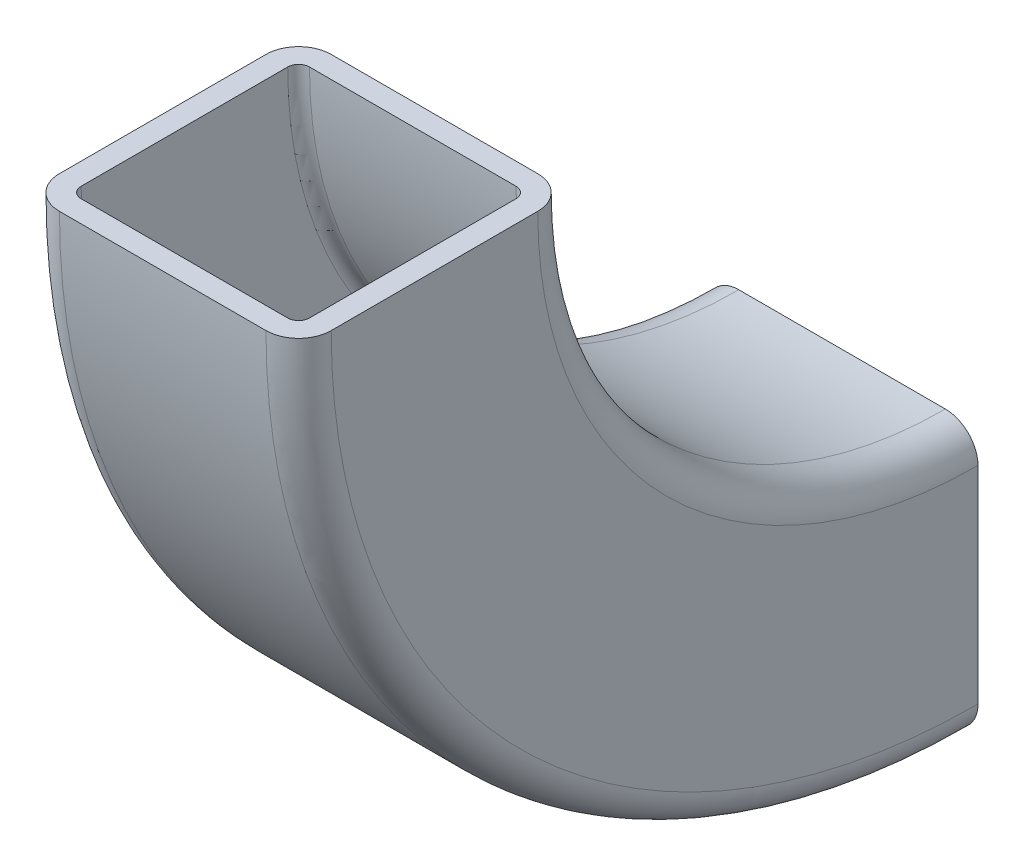
ISO-10303-21;
HEADER;
FILE_DESCRIPTION(('STEP AP214'),'2;1');
FILE_NAME('part.step','',(''),(''),'','','');
FILE_SCHEMA(('AUTOMOTIVE_DESIGN { 1 0 10303 214 1 1 1 1 }'));
ENDSEC;
DATA;
#1=APPLICATION_CONTEXT('core data for automotive mechanical design processes');
#2=APPLICATION_PROTOCOL_DEFINITION('international standard','automotive_design',2000,#1);
#3=PRODUCT_CONTEXT('',#1,'mechanical');
#4=PRODUCT('Part','Part','',(#3));
#5=PRODUCT_RELATED_PRODUCT_CATEGORY('part','',(#4));
#6=PRODUCT_DEFINITION_FORMATION('','',#4);
#7=PRODUCT_DEFINITION_CONTEXT('part definition',#1,'design');
#8=PRODUCT_DEFINITION('design','',#6,#7);
#9=PRODUCT_DEFINITION_SHAPE('','',#8);
#10=(LENGTH_UNIT() NAMED_UNIT(*) SI_UNIT(.MILLI.,.METRE.));
#11=(NAMED_UNIT(*) PLANE_ANGLE_UNIT() SI_UNIT($,.RADIAN.));
#12=(NAMED_UNIT(*) SI_UNIT($,.STERADIAN.) SOLID_ANGLE_UNIT());
#13=UNCERTAINTY_MEASURE_WITH_UNIT(LENGTH_MEASURE(1.E-05),#10,'distance_accuracy_value','');
#14=(GEOMETRIC_REPRESENTATION_CONTEXT(3) GLOBAL_UNCERTAINTY_ASSIGNED_CONTEXT((#13)) GLOBAL_UNIT_ASSIGNED_CONTEXT((#10,
#11,#12)) REPRESENTATION_CONTEXT('',''));
#15=CARTESIAN_POINT('',(0.,0.,0.));
#16=DIRECTION('',(0.,0.,1.));
#17=DIRECTION('',(1.,0.,0.));
#18=AXIS2_PLACEMENT_3D('',#15,#16,#17);
#19=CARTESIAN_POINT('',(0.,0.,0.));
#20=DIRECTION('',(0.,0.,-1.));
#21=DIRECTION('',(0.,-1.,0.));
#22=AXIS2_PLACEMENT_3D('',#19,#20,#21);
#23=PLANE('',#22);
#24=CARTESIAN_POINT('',(-9.5,-9.5,0.));
#25=DIRECTION('',(0.,0.,-1.));
#26=DIRECTION('',(1.,0.,0.));
#27=AXIS2_PLACEMENT_3D('',#24,#25,#26);
#28=CIRCLE('',#27,3.);
#29=CARTESIAN_POINT('',(-9.5,-12.5,0.));
#30=VERTEX_POINT('',#29);
#31=CARTESIAN_POINT('',(-12.5,-9.5,0.));
#32=VERTEX_POINT('',#31);
#33=EDGE_CURVE('E27',#30,#32,#28,.T.);
#34=ORIENTED_EDGE('',*,*,#33,.T.);
#35=DIRECTION('',(0.,1.,0.));
#36=VECTOR('',#35,1.);
#37=CARTESIAN_POINT('',(-12.5,-9.5,0.));
#38=LINE('',#37,#36);
#39=CARTESIAN_POINT('',(-12.5,9.5,0.));
#40=VERTEX_POINT('',#39);
#41=EDGE_CURVE('E238',#32,#40,#38,.T.);
#42=ORIENTED_EDGE('',*,*,#41,.T.);
#43=CARTESIAN_POINT('',(-9.5,9.5,0.));
#44=DIRECTION('',(0.,0.,-1.));
#45=DIRECTION('',(0.,-1.,0.));
#46=AXIS2_PLACEMENT_3D('',#43,#44,#45);
#47=CIRCLE('',#46,3.);
#48=CARTESIAN_POINT('',(-9.5,12.5,0.));
#49=VERTEX_POINT('',#48);
#50=EDGE_CURVE('E240',#40,#49,#47,.T.);
#51=ORIENTED_EDGE('',*,*,#50,.T.);
#52=DIRECTION('',(1.,0.,0.));
#53=VECTOR('',#52,1.);
#54=CARTESIAN_POINT('',(-9.5,12.5,0.));
#55=LINE('',#54,#53);
#56=CARTESIAN_POINT('',(9.5,12.5,0.));
#57=VERTEX_POINT('',#56);
#58=EDGE_CURVE('E117',#49,#57,#55,.T.);
#59=ORIENTED_EDGE('',*,*,#58,.T.);
#60=CARTESIAN_POINT('',(9.5,9.5,0.));
#61=DIRECTION('',(0.,0.,-1.));
#62=DIRECTION('',(-1.,0.,0.));
#63=AXIS2_PLACEMENT_3D('',#60,#61,#62);
#64=CIRCLE('',#63,3.);
#65=CARTESIAN_POINT('',(12.5,9.5,0.));
#66=VERTEX_POINT('',#65);
#67=EDGE_CURVE('E196',#57,#66,#64,.T.);
#68=ORIENTED_EDGE('',*,*,#67,.T.);
#69=DIRECTION('',(0.,-1.,0.));
#70=VECTOR('',#69,1.);
#71=CARTESIAN_POINT('',(12.5,9.5,0.));
#72=LINE('',#71,#70);
#73=CARTESIAN_POINT('',(12.5,-9.5,0.));
#74=VERTEX_POINT('',#73);
#75=EDGE_CURVE('E183',#66,#74,#72,.T.);
#76=ORIENTED_EDGE('',*,*,#75,.T.);
#77=CARTESIAN_POINT('',(9.5,-9.5,0.));
#78=DIRECTION('',(0.,0.,-1.));
#79=DIRECTION('',(0.,1.,0.));
#80=AXIS2_PLACEMENT_3D('',#77,#78,#79);
#81=CIRCLE('',#80,3.);
#82=CARTESIAN_POINT('',(9.5,-12.5,0.));
#83=VERTEX_POINT('',#82);
#84=EDGE_CURVE('E210',#74,#83,#81,.T.);
#85=ORIENTED_EDGE('',*,*,#84,.T.);
#86=DIRECTION('',(-1.,0.,0.));
#87=VECTOR('',#86,1.);
#88=CARTESIAN_POINT('',(9.5,-12.5,0.));
#89=LINE('',#88,#87);
#90=EDGE_CURVE('E368',#83,#30,#89,.T.);
#91=ORIENTED_EDGE('',*,*,#90,.T.);
#92=EDGE_LOOP('',(#34,#42,#51,#59,#68,#76,#85,#91));
#93=FACE_BOUND('',#92,.T.);
#94=DIRECTION('',(-1.,0.,0.));
#95=VECTOR('',#94,1.);
#96=CARTESIAN_POINT('',(0.,10.5,0.));
#97=LINE('',#96,#95);
#98=CARTESIAN_POINT('',(9.5,10.5,0.));
#99=VERTEX_POINT('',#98);
#100=CARTESIAN_POINT('',(-9.5,10.5,0.));
#101=VERTEX_POINT('',#100);
#102=EDGE_CURVE('E294',#99,#101,#97,.T.);
#103=ORIENTED_EDGE('',*,*,#102,.T.);
#104=CARTESIAN_POINT('',(-9.5,9.5,0.));
#105=DIRECTION('',(0.,0.,1.));
#106=DIRECTION('',(0.,-1.,0.));
#107=AXIS2_PLACEMENT_3D('',#104,#105,#106);
#108=CIRCLE('',#107,1.);
#109=CARTESIAN_POINT('',(-10.5,9.5,0.));
#110=VERTEX_POINT('',#109);
#111=EDGE_CURVE('E239',#101,#110,#108,.T.);
#112=ORIENTED_EDGE('',*,*,#111,.T.);
#113=DIRECTION('',(0.,-1.,0.));
#114=VECTOR('',#113,1.);
#115=CARTESIAN_POINT('',(-10.5,4.75,0.));
#116=LINE('',#115,#114);
#117=CARTESIAN_POINT('',(-10.5,-9.5,0.));
#118=VERTEX_POINT('',#117);
#119=EDGE_CURVE('E287',#110,#118,#116,.T.);
#120=ORIENTED_EDGE('',*,*,#119,.T.);
#121=CARTESIAN_POINT('',(-9.5,-9.5,0.));
#122=DIRECTION('',(0.,0.,1.));
#123=DIRECTION('',(0.,-1.,0.));
#124=AXIS2_PLACEMENT_3D('',#121,#122,#123);
#125=CIRCLE('',#124,1.);
#126=CARTESIAN_POINT('',(-9.5,-10.5,0.));
#127=VERTEX_POINT('',#126);
#128=EDGE_CURVE('E214',#118,#127,#125,.T.);
#129=ORIENTED_EDGE('',*,*,#128,.T.);
#130=DIRECTION('',(1.,0.,0.));
#131=VECTOR('',#130,1.);
#132=CARTESIAN_POINT('',(0.,-10.5,0.));
#133=LINE('',#132,#131);
#134=CARTESIAN_POINT('',(9.5,-10.5,0.));
#135=VERTEX_POINT('',#134);
#136=EDGE_CURVE('E230',#127,#135,#133,.T.);
#137=ORIENTED_EDGE('',*,*,#136,.T.);
#138=CARTESIAN_POINT('',(9.5,-9.5,0.));
#139=DIRECTION('',(0.,0.,1.));
#140=DIRECTION('',(0.,-1.,0.));
#141=AXIS2_PLACEMENT_3D('',#138,#139,#140);
#142=CIRCLE('',#141,1.);
#143=CARTESIAN_POINT('',(10.5,-9.5,0.));
#144=VERTEX_POINT('',#143);
#145=EDGE_CURVE('E299',#135,#144,#142,.T.);
#146=ORIENTED_EDGE('',*,*,#145,.T.);
#147=DIRECTION('',(0.,1.,0.));
#148=VECTOR('',#147,1.);
#149=CARTESIAN_POINT('',(10.5,-4.75,0.));
#150=LINE('',#149,#148);
#151=CARTESIAN_POINT('',(10.5,9.5,0.));
#152=VERTEX_POINT('',#151);
#153=EDGE_CURVE('E310',#144,#152,#150,.T.);
#154=ORIENTED_EDGE('',*,*,#153,.T.);
#155=CARTESIAN_POINT('',(9.5,9.5,0.));
#156=DIRECTION('',(0.,0.,1.));
#157=DIRECTION('',(0.,-1.,0.));
#158=AXIS2_PLACEMENT_3D('',#155,#156,#157);
#159=CIRCLE('',#158,1.);
#160=EDGE_CURVE('E225',#152,#99,#159,.T.);
#161=ORIENTED_EDGE('',*,*,#160,.T.);
#162=EDGE_LOOP('',(#103,#112,#120,#129,#137,#146,#154,#161));
#163=FACE_BOUND('',#162,.T.);
#164=ADVANCED_FACE('F16',(#93,#163),#23,.T.);
#165=CARTESIAN_POINT('',(0.,50.0000000119264,50.));
#166=DIRECTION('',(0.,-1.,2.38529135162326E-10));
#167=DIRECTION('',(-1.,0.,0.));
#168=AXIS2_PLACEMENT_3D('',#165,#166,#167);
#169=PLANE('',#168);
#170=CARTESIAN_POINT('',(-9.5,50.0000000141925,59.5));
#171=DIRECTION('',(0.,1.,-2.38529135162326E-10));
#172=DIRECTION('',(1.,0.,0.));
#173=AXIS2_PLACEMENT_3D('',#170,#171,#172);
#174=CIRCLE('',#173,3.);
#175=CARTESIAN_POINT('',(-12.5,50.0000000141925,59.5));
#176=VERTEX_POINT('',#175);
#177=CARTESIAN_POINT('',(-9.5,50.0000000149081,62.5));
#178=VERTEX_POINT('',#177);
#179=EDGE_CURVE('E11',#176,#178,#174,.T.);
#180=ORIENTED_EDGE('',*,*,#179,.T.);
#181=DIRECTION('',(1.,0.,0.));
#182=VECTOR('',#181,1.);
#183=CARTESIAN_POINT('',(9.5,50.0000000149081,62.5));
#184=LINE('',#183,#182);
#185=CARTESIAN_POINT('',(9.5,50.0000000149081,62.5));
#186=VERTEX_POINT('',#185);
#187=EDGE_CURVE('E345',#178,#186,#184,.T.);
#188=ORIENTED_EDGE('',*,*,#187,.T.);
#189=CARTESIAN_POINT('',(9.5,50.0000000141925,59.5));
#190=DIRECTION('',(0.,1.,-2.38529135162326E-10));
#191=DIRECTION('',(0.,-2.38529135162326E-10,-1.));
#192=AXIS2_PLACEMENT_3D('',#189,#190,#191);
#193=CIRCLE('',#192,3.);
#194=CARTESIAN_POINT('',(12.5,50.0000000141925,59.5));
#195=VERTEX_POINT('',#194);
#196=EDGE_CURVE('E177',#186,#195,#193,.T.);
#197=ORIENTED_EDGE('',*,*,#196,.T.);
#198=DIRECTION('',(0.,-2.38529135162326E-10,-1.));
#199=VECTOR('',#198,1.);
#200=CARTESIAN_POINT('',(12.5,50.0000000096604,40.5));
#201=LINE('',#200,#199);
#202=CARTESIAN_POINT('',(12.5,50.0000000096604,40.5));
#203=VERTEX_POINT('',#202);
#204=EDGE_CURVE('E170',#195,#203,#201,.T.);
#205=ORIENTED_EDGE('',*,*,#204,.T.);
#206=CARTESIAN_POINT('',(9.5,50.0000000096604,40.5));
#207=DIRECTION('',(0.,1.,-2.38529135162326E-10));
#208=DIRECTION('',(-1.,0.,0.));
#209=AXIS2_PLACEMENT_3D('',#206,#207,#208);
#210=CIRCLE('',#209,3.);
#211=CARTESIAN_POINT('',(9.5,50.0000000089448,37.5));
#212=VERTEX_POINT('',#211);
#213=EDGE_CURVE('E20',#203,#212,#210,.T.);
#214=ORIENTED_EDGE('',*,*,#213,.T.);
#215=DIRECTION('',(-1.,0.,0.));
#216=VECTOR('',#215,1.);
#217=CARTESIAN_POINT('',(-9.5,50.0000000089448,37.5));
#218=LINE('',#217,#216);
#219=CARTESIAN_POINT('',(-9.5,50.0000000089448,37.5));
#220=VERTEX_POINT('',#219);
#221=EDGE_CURVE('E206',#212,#220,#218,.T.);
#222=ORIENTED_EDGE('',*,*,#221,.T.);
#223=CARTESIAN_POINT('',(-9.5,50.0000000096604,40.5));
#224=DIRECTION('',(0.,1.,-2.38529135162326E-10));
#225=DIRECTION('',(0.,2.38529135162326E-10,1.));
#226=AXIS2_PLACEMENT_3D('',#223,#224,#225);
#227=CIRCLE('',#226,3.);
#228=CARTESIAN_POINT('',(-12.5,50.0000000096604,40.5));
#229=VERTEX_POINT('',#228);
#230=EDGE_CURVE('E128',#220,#229,#227,.T.);
#231=ORIENTED_EDGE('',*,*,#230,.T.);
#232=DIRECTION('',(0.,2.38529135162326E-10,1.));
#233=VECTOR('',#232,1.);
#234=CARTESIAN_POINT('',(-12.5,50.0000000141925,59.5));
#235=LINE('',#234,#233);
#236=EDGE_CURVE('E249',#229,#176,#235,.T.);
#237=ORIENTED_EDGE('',*,*,#236,.T.);
#238=EDGE_LOOP('',(#180,#188,#197,#205,#214,#222,#231,#237));
#239=FACE_BOUND('',#238,.T.);
#240=DIRECTION('',(1.,0.,0.));
#241=VECTOR('',#240,1.);
#242=CARTESIAN_POINT('',(0.,50.0000000094219,39.5));
#243=LINE('',#242,#241);
#244=CARTESIAN_POINT('',(-9.5,50.0000000094219,39.5));
#245=VERTEX_POINT('',#244);
#246=CARTESIAN_POINT('',(9.5,50.0000000094219,39.5));
#247=VERTEX_POINT('',#246);
#248=EDGE_CURVE('E268',#245,#247,#243,.T.);
#249=ORIENTED_EDGE('',*,*,#248,.T.);
#250=CARTESIAN_POINT('',(9.5,50.0000000096604,40.5));
#251=DIRECTION('',(0.,-1.,2.38529135162326E-10));
#252=DIRECTION('',(0.,2.38529135162326E-10,1.));
#253=AXIS2_PLACEMENT_3D('',#250,#251,#252);
#254=CIRCLE('',#253,1.);
#255=CARTESIAN_POINT('',(10.5,50.0000000096604,40.5));
#256=VERTEX_POINT('',#255);
#257=EDGE_CURVE('E306',#247,#256,#254,.T.);
#258=ORIENTED_EDGE('',*,*,#257,.T.);
#259=DIRECTION('',(0.,2.38529135162326E-10,1.));
#260=VECTOR('',#259,1.);
#261=CARTESIAN_POINT('',(10.5,50.0000000059632,24.9999999929037));
#262=LINE('',#261,#260);
#263=CARTESIAN_POINT('',(10.5,50.0000000141925,59.5));
#264=VERTEX_POINT('',#263);
#265=EDGE_CURVE('E302',#256,#264,#262,.T.);
#266=ORIENTED_EDGE('',*,*,#265,.T.);
#267=CARTESIAN_POINT('',(9.5,50.0000000141925,59.5));
#268=DIRECTION('',(0.,-1.,2.38529135162326E-10));
#269=DIRECTION('',(0.,2.38529135162326E-10,1.));
#270=AXIS2_PLACEMENT_3D('',#267,#268,#269);
#271=CIRCLE('',#270,1.);
#272=CARTESIAN_POINT('',(9.5,50.000000014431,60.5));
#273=VERTEX_POINT('',#272);
#274=EDGE_CURVE('E234',#264,#273,#271,.T.);
#275=ORIENTED_EDGE('',*,*,#274,.T.);
#276=DIRECTION('',(-1.,0.,0.));
#277=VECTOR('',#276,1.);
#278=CARTESIAN_POINT('',(0.,50.000000014431,60.5));
#279=LINE('',#278,#277);
#280=CARTESIAN_POINT('',(-9.5,50.000000014431,60.5));
#281=VERTEX_POINT('',#280);
#282=EDGE_CURVE('E218',#273,#281,#279,.T.);
#283=ORIENTED_EDGE('',*,*,#282,.T.);
#284=CARTESIAN_POINT('',(-9.5,50.0000000141925,59.5));
#285=DIRECTION('',(0.,-1.,2.38529135162326E-10));
#286=DIRECTION('',(0.,2.38529135162326E-10,1.));
#287=AXIS2_PLACEMENT_3D('',#284,#285,#286);
#288=CIRCLE('',#287,1.);
#289=CARTESIAN_POINT('',(-10.5,50.0000000141925,59.5));
#290=VERTEX_POINT('',#289);
#291=EDGE_CURVE('E283',#281,#290,#288,.T.);
#292=ORIENTED_EDGE('',*,*,#291,.T.);
#293=DIRECTION('',(0.,-2.38529135162326E-10,-1.));
#294=VECTOR('',#293,1.);
#295=CARTESIAN_POINT('',(-10.5,50.0000000059632,24.9999999951698));
#296=LINE('',#295,#294);
#297=CARTESIAN_POINT('',(-10.5,50.0000000096604,40.5));
#298=VERTEX_POINT('',#297);
#299=EDGE_CURVE('E277',#290,#298,#296,.T.);
#300=ORIENTED_EDGE('',*,*,#299,.T.);
#301=CARTESIAN_POINT('',(-9.5,50.0000000096604,40.5));
#302=DIRECTION('',(0.,-1.,2.38529135162326E-10));
#303=DIRECTION('',(0.,2.38529135162326E-10,1.));
#304=AXIS2_PLACEMENT_3D('',#301,#302,#303);
#305=CIRCLE('',#304,1.);
#306=EDGE_CURVE('E235',#298,#245,#305,.T.);
#307=ORIENTED_EDGE('',*,*,#306,.T.);
#308=EDGE_LOOP('',(#249,#258,#266,#275,#283,#292,#300,#307));
#309=FACE_BOUND('',#308,.T.);
#310=ADVANCED_FACE('F172',(#239,#309),#169,.F.);
#311=CARTESIAN_POINT('',(-9.5,50.,0.));
#312=DIRECTION('',(-1.,0.,0.));
#313=DIRECTION('',(0.,0.,1.));
#314=AXIS2_PLACEMENT_3D('',#311,#312,#313);
#315=TOROIDAL_SURFACE('',#314,59.5,3.);
#316=ORIENTED_EDGE('',*,*,#33,.F.);
#317=CARTESIAN_POINT('',(-9.5,50.,0.));
#318=DIRECTION('',(-1.,0.,0.));
#319=DIRECTION('',(0.,-1.,0.));
#320=AXIS2_PLACEMENT_3D('',#317,#318,#319);
#321=CIRCLE('',#320,62.5);
#322=EDGE_CURVE('E224',#30,#178,#321,.T.);
#323=ORIENTED_EDGE('',*,*,#322,.T.);
#324=ORIENTED_EDGE('',*,*,#179,.F.);
#325=CARTESIAN_POINT('',(-12.5,50.,0.));
#326=DIRECTION('',(-1.,0.,0.));
#327=DIRECTION('',(0.,-1.,0.));
#328=AXIS2_PLACEMENT_3D('',#325,#326,#327);
#329=CIRCLE('',#328,59.5);
#330=EDGE_CURVE('E257',#32,#176,#329,.T.);
#331=ORIENTED_EDGE('',*,*,#330,.F.);
#332=EDGE_LOOP('',(#316,#323,#324,#331));
#333=FACE_BOUND('',#332,.T.);
#334=ADVANCED_FACE('F399',(#333),#315,.T.);
#335=CARTESIAN_POINT('',(0.,50.,0.));
#336=DIRECTION('',(-1.,0.,0.));
#337=DIRECTION('',(0.,-1.,0.));
#338=AXIS2_PLACEMENT_3D('',#335,#336,#337);
#339=CYLINDRICAL_SURFACE('',#338,62.5);
#340=ORIENTED_EDGE('',*,*,#90,.F.);
#341=CARTESIAN_POINT('',(9.5,50.,0.));
#342=DIRECTION('',(-1.,0.,0.));
#343=DIRECTION('',(0.,-1.,0.));
#344=AXIS2_PLACEMENT_3D('',#341,#342,#343);
#345=CIRCLE('',#344,62.5);
#346=EDGE_CURVE('E264',#83,#186,#345,.T.);
#347=ORIENTED_EDGE('',*,*,#346,.T.);
#348=ORIENTED_EDGE('',*,*,#187,.F.);
#349=ORIENTED_EDGE('',*,*,#322,.F.);
#350=EDGE_LOOP('',(#340,#347,#348,#349));
#351=FACE_BOUND('',#350,.T.);
#352=ADVANCED_FACE('F384',(#351),#339,.T.);
#353=CARTESIAN_POINT('',(9.5,50.,0.));
#354=DIRECTION('',(-1.,0.,0.));
#355=DIRECTION('',(0.,0.,1.));
#356=AXIS2_PLACEMENT_3D('',#353,#354,#355);
#357=TOROIDAL_SURFACE('',#356,59.5,3.);
#358=ORIENTED_EDGE('',*,*,#84,.F.);
#359=CARTESIAN_POINT('',(12.5,50.,0.));
#360=DIRECTION('',(-1.,0.,0.));
#361=DIRECTION('',(0.,-1.,0.));
#362=AXIS2_PLACEMENT_3D('',#359,#360,#361);
#363=CIRCLE('',#362,59.5);
#364=EDGE_CURVE('E182',#74,#195,#363,.T.);
#365=ORIENTED_EDGE('',*,*,#364,.T.);
#366=ORIENTED_EDGE('',*,*,#196,.F.);
#367=ORIENTED_EDGE('',*,*,#346,.F.);
#368=EDGE_LOOP('',(#358,#365,#366,#367));
#369=FACE_BOUND('',#368,.T.);
#370=ADVANCED_FACE('F387',(#369),#357,.T.);
#371=CARTESIAN_POINT('',(12.5,-9.5,0.));
#372=DIRECTION('',(1.,0.,0.));
#373=DIRECTION('',(0.,0.,-1.));
#374=AXIS2_PLACEMENT_3D('',#371,#372,#373);
#375=PLANE('',#374);
#376=ORIENTED_EDGE('',*,*,#75,.F.);
#377=CARTESIAN_POINT('',(12.5,50.,0.));
#378=DIRECTION('',(-1.,0.,0.));
#379=DIRECTION('',(0.,-1.,0.));
#380=AXIS2_PLACEMENT_3D('',#377,#378,#379);
#381=CIRCLE('',#380,40.5);
#382=EDGE_CURVE('E186',#66,#203,#381,.T.);
#383=ORIENTED_EDGE('',*,*,#382,.T.);
#384=ORIENTED_EDGE('',*,*,#204,.F.);
#385=ORIENTED_EDGE('',*,*,#364,.F.);
#386=EDGE_LOOP('',(#376,#383,#384,#385));
#387=FACE_BOUND('',#386,.T.);
#388=ADVANCED_FACE('F187',(#387),#375,.T.);
#389=CARTESIAN_POINT('',(9.5,50.,0.));
#390=DIRECTION('',(-1.,0.,0.));
#391=DIRECTION('',(0.,0.,1.));
#392=AXIS2_PLACEMENT_3D('',#389,#390,#391);
#393=TOROIDAL_SURFACE('',#392,40.5,3.);
#394=ORIENTED_EDGE('',*,*,#67,.F.);
#395=CARTESIAN_POINT('',(9.5,50.,0.));
#396=DIRECTION('',(-1.,0.,0.));
#397=DIRECTION('',(0.,-1.,0.));
#398=AXIS2_PLACEMENT_3D('',#395,#396,#397);
#399=CIRCLE('',#398,37.5);
#400=EDGE_CURVE('E193',#57,#212,#399,.T.);
#401=ORIENTED_EDGE('',*,*,#400,.T.);
#402=ORIENTED_EDGE('',*,*,#213,.F.);
#403=ORIENTED_EDGE('',*,*,#382,.F.);
#404=EDGE_LOOP('',(#394,#401,#402,#403));
#405=FACE_BOUND('',#404,.T.);
#406=ADVANCED_FACE('F18',(#405),#393,.T.);
#407=CARTESIAN_POINT('',(0.,50.,0.));
#408=DIRECTION('',(-1.,0.,0.));
#409=DIRECTION('',(0.,-1.,0.));
#410=AXIS2_PLACEMENT_3D('',#407,#408,#409);
#411=CYLINDRICAL_SURFACE('',#410,37.5);
#412=ORIENTED_EDGE('',*,*,#58,.F.);
#413=CARTESIAN_POINT('',(-9.5,50.,0.));
#414=DIRECTION('',(-1.,0.,0.));
#415=DIRECTION('',(0.,-1.,0.));
#416=AXIS2_PLACEMENT_3D('',#413,#414,#415);
#417=CIRCLE('',#416,37.5);
#418=EDGE_CURVE('E219',#49,#220,#417,.T.);
#419=ORIENTED_EDGE('',*,*,#418,.T.);
#420=ORIENTED_EDGE('',*,*,#221,.F.);
#421=ORIENTED_EDGE('',*,*,#400,.F.);
#422=EDGE_LOOP('',(#412,#419,#420,#421));
#423=FACE_BOUND('',#422,.T.);
#424=ADVANCED_FACE('F436',(#423),#411,.F.);
#425=CARTESIAN_POINT('',(-9.5,50.,0.));
#426=DIRECTION('',(-1.,0.,0.));
#427=DIRECTION('',(0.,0.,1.));
#428=AXIS2_PLACEMENT_3D('',#425,#426,#427);
#429=TOROIDAL_SURFACE('',#428,40.5,3.);
#430=ORIENTED_EDGE('',*,*,#50,.F.);
#431=CARTESIAN_POINT('',(-12.5,50.,0.));
#432=DIRECTION('',(-1.,0.,0.));
#433=DIRECTION('',(0.,-1.,0.));
#434=AXIS2_PLACEMENT_3D('',#431,#432,#433);
#435=CIRCLE('',#434,40.5);
#436=EDGE_CURVE('E243',#40,#229,#435,.T.);
#437=ORIENTED_EDGE('',*,*,#436,.T.);
#438=ORIENTED_EDGE('',*,*,#230,.F.);
#439=ORIENTED_EDGE('',*,*,#418,.F.);
#440=EDGE_LOOP('',(#430,#437,#438,#439));
#441=FACE_BOUND('',#440,.T.);
#442=ADVANCED_FACE('F431',(#441),#429,.T.);
#443=CARTESIAN_POINT('',(-12.5,9.5,0.));
#444=DIRECTION('',(-1.,0.,0.));
#445=DIRECTION('',(0.,1.,0.));
#446=AXIS2_PLACEMENT_3D('',#443,#444,#445);
#447=PLANE('',#446);
#448=ORIENTED_EDGE('',*,*,#41,.F.);
#449=ORIENTED_EDGE('',*,*,#330,.T.);
#450=ORIENTED_EDGE('',*,*,#236,.F.);
#451=ORIENTED_EDGE('',*,*,#436,.F.);
#452=EDGE_LOOP('',(#448,#449,#450,#451));
#453=FACE_BOUND('',#452,.T.);
#454=ADVANCED_FACE('F429',(#453),#447,.T.);
#455=CARTESIAN_POINT('',(-9.5,50.,0.));
#456=DIRECTION('',(-1.,0.,0.));
#457=DIRECTION('',(0.,0.,1.));
#458=AXIS2_PLACEMENT_3D('',#455,#456,#457);
#459=TOROIDAL_SURFACE('',#458,40.5,1.);
#460=ORIENTED_EDGE('',*,*,#111,.F.);
#461=CARTESIAN_POINT('',(-9.5,50.,0.));
#462=DIRECTION('',(-1.,0.,0.));
#463=DIRECTION('',(0.,-1.,0.));
#464=AXIS2_PLACEMENT_3D('',#461,#462,#463);
#465=CIRCLE('',#464,39.5);
#466=EDGE_CURVE('E229',#101,#245,#465,.T.);
#467=ORIENTED_EDGE('',*,*,#466,.T.);
#468=ORIENTED_EDGE('',*,*,#306,.F.);
#469=CARTESIAN_POINT('',(-10.5,50.,0.));
#470=DIRECTION('',(-1.,0.,0.));
#471=DIRECTION('',(0.,-1.,0.));
#472=AXIS2_PLACEMENT_3D('',#469,#470,#471);
#473=CIRCLE('',#472,40.5);
#474=EDGE_CURVE('E298',#110,#298,#473,.T.);
#475=ORIENTED_EDGE('',*,*,#474,.F.);
#476=EDGE_LOOP('',(#460,#467,#468,#475));
#477=FACE_BOUND('',#476,.T.);
#478=ADVANCED_FACE('F321',(#477),#459,.F.);
#479=CARTESIAN_POINT('',(-10.5,9.5,0.));
#480=DIRECTION('',(-1.,0.,0.));
#481=DIRECTION('',(0.,1.,0.));
#482=AXIS2_PLACEMENT_3D('',#479,#480,#481);
#483=PLANE('',#482);
#484=ORIENTED_EDGE('',*,*,#119,.F.);
#485=ORIENTED_EDGE('',*,*,#474,.T.);
#486=ORIENTED_EDGE('',*,*,#299,.F.);
#487=CARTESIAN_POINT('',(-10.5,50.,0.));
#488=DIRECTION('',(-1.,0.,0.));
#489=DIRECTION('',(0.,-1.,0.));
#490=AXIS2_PLACEMENT_3D('',#487,#488,#489);
#491=CIRCLE('',#490,59.5);
#492=EDGE_CURVE('E217',#118,#290,#491,.T.);
#493=ORIENTED_EDGE('',*,*,#492,.F.);
#494=EDGE_LOOP('',(#484,#485,#486,#493));
#495=FACE_BOUND('',#494,.T.);
#496=ADVANCED_FACE('F334',(#495),#483,.F.);
#497=CARTESIAN_POINT('',(-9.5,50.,0.));
#498=DIRECTION('',(-1.,0.,0.));
#499=DIRECTION('',(0.,0.,1.));
#500=AXIS2_PLACEMENT_3D('',#497,#498,#499);
#501=TOROIDAL_SURFACE('',#500,59.5,1.);
#502=ORIENTED_EDGE('',*,*,#128,.F.);
#503=ORIENTED_EDGE('',*,*,#492,.T.);
#504=ORIENTED_EDGE('',*,*,#291,.F.);
#505=CARTESIAN_POINT('',(-9.5,50.,0.));
#506=DIRECTION('',(-1.,0.,0.));
#507=DIRECTION('',(0.,-1.,0.));
#508=AXIS2_PLACEMENT_3D('',#505,#506,#507);
#509=CIRCLE('',#508,60.5);
#510=EDGE_CURVE('E233',#127,#281,#509,.T.);
#511=ORIENTED_EDGE('',*,*,#510,.F.);
#512=EDGE_LOOP('',(#502,#503,#504,#511));
#513=FACE_BOUND('',#512,.T.);
#514=ADVANCED_FACE('F425',(#513),#501,.F.);
#515=CARTESIAN_POINT('',(0.,50.,0.));
#516=DIRECTION('',(-1.,0.,0.));
#517=DIRECTION('',(0.,-1.,0.));
#518=AXIS2_PLACEMENT_3D('',#515,#516,#517);
#519=CYLINDRICAL_SURFACE('',#518,60.5);
#520=ORIENTED_EDGE('',*,*,#136,.F.);
#521=ORIENTED_EDGE('',*,*,#510,.T.);
#522=ORIENTED_EDGE('',*,*,#282,.F.);
#523=CARTESIAN_POINT('',(9.5,50.,0.));
#524=DIRECTION('',(-1.,0.,0.));
#525=DIRECTION('',(0.,-1.,0.));
#526=AXIS2_PLACEMENT_3D('',#523,#524,#525);
#527=CIRCLE('',#526,60.5);
#528=EDGE_CURVE('E301',#135,#273,#527,.T.);
#529=ORIENTED_EDGE('',*,*,#528,.F.);
#530=EDGE_LOOP('',(#520,#521,#522,#529));
#531=FACE_BOUND('',#530,.T.);
#532=ADVANCED_FACE('F421',(#531),#519,.F.);
#533=CARTESIAN_POINT('',(9.5,50.,0.));
#534=DIRECTION('',(-1.,0.,0.));
#535=DIRECTION('',(0.,0.,1.));
#536=AXIS2_PLACEMENT_3D('',#533,#534,#535);
#537=TOROIDAL_SURFACE('',#536,59.5,1.);
#538=ORIENTED_EDGE('',*,*,#145,.F.);
#539=ORIENTED_EDGE('',*,*,#528,.T.);
#540=ORIENTED_EDGE('',*,*,#274,.F.);
#541=CARTESIAN_POINT('',(10.5,50.,0.));
#542=DIRECTION('',(-1.,0.,0.));
#543=DIRECTION('',(0.,-1.,0.));
#544=AXIS2_PLACEMENT_3D('',#541,#542,#543);
#545=CIRCLE('',#544,59.5);
#546=EDGE_CURVE('E346',#144,#264,#545,.T.);
#547=ORIENTED_EDGE('',*,*,#546,.F.);
#548=EDGE_LOOP('',(#538,#539,#540,#547));
#549=FACE_BOUND('',#548,.T.);
#550=ADVANCED_FACE('F424',(#549),#537,.F.);
#551=CARTESIAN_POINT('',(10.5,-9.5,0.));
#552=DIRECTION('',(1.,0.,0.));
#553=DIRECTION('',(0.,0.,-1.));
#554=AXIS2_PLACEMENT_3D('',#551,#552,#553);
#555=PLANE('',#554);
#556=ORIENTED_EDGE('',*,*,#153,.F.);
#557=ORIENTED_EDGE('',*,*,#546,.T.);
#558=ORIENTED_EDGE('',*,*,#265,.F.);
#559=CARTESIAN_POINT('',(10.5,50.,0.));
#560=DIRECTION('',(-1.,0.,0.));
#561=DIRECTION('',(0.,-1.,0.));
#562=AXIS2_PLACEMENT_3D('',#559,#560,#561);
#563=CIRCLE('',#562,40.5);
#564=EDGE_CURVE('E228',#152,#256,#563,.T.);
#565=ORIENTED_EDGE('',*,*,#564,.F.);
#566=EDGE_LOOP('',(#556,#557,#558,#565));
#567=FACE_BOUND('',#566,.T.);
#568=ADVANCED_FACE('F417',(#567),#555,.F.);
#569=CARTESIAN_POINT('',(9.5,50.,0.));
#570=DIRECTION('',(-1.,0.,0.));
#571=DIRECTION('',(0.,0.,1.));
#572=AXIS2_PLACEMENT_3D('',#569,#570,#571);
#573=TOROIDAL_SURFACE('',#572,40.5,1.);
#574=ORIENTED_EDGE('',*,*,#160,.F.);
#575=ORIENTED_EDGE('',*,*,#564,.T.);
#576=ORIENTED_EDGE('',*,*,#257,.F.);
#577=CARTESIAN_POINT('',(9.5,50.,0.));
#578=DIRECTION('',(-1.,0.,0.));
#579=DIRECTION('',(0.,-1.,0.));
#580=AXIS2_PLACEMENT_3D('',#577,#578,#579);
#581=CIRCLE('',#580,39.5);
#582=EDGE_CURVE('E272',#99,#247,#581,.T.);
#583=ORIENTED_EDGE('',*,*,#582,.F.);
#584=EDGE_LOOP('',(#574,#575,#576,#583));
#585=FACE_BOUND('',#584,.T.);
#586=ADVANCED_FACE('F414',(#585),#573,.F.);
#587=CARTESIAN_POINT('',(0.,50.,0.));
#588=DIRECTION('',(-1.,0.,0.));
#589=DIRECTION('',(0.,-1.,0.));
#590=AXIS2_PLACEMENT_3D('',#587,#588,#589);
#591=CYLINDRICAL_SURFACE('',#590,39.5);
#592=ORIENTED_EDGE('',*,*,#102,.F.);
#593=ORIENTED_EDGE('',*,*,#582,.T.);
#594=ORIENTED_EDGE('',*,*,#248,.F.);
#595=ORIENTED_EDGE('',*,*,#466,.F.);
#596=EDGE_LOOP('',(#592,#593,#594,#595));
#597=FACE_BOUND('',#596,.T.);
#598=ADVANCED_FACE('F325',(#597),#591,.T.);
#599=CLOSED_SHELL('',(#164,#310,#334,#352,#370,#388,#406,#424,#442,#454,#478,#496,#514,#532,
#550,#568,#586,#598));
#600=MANIFOLD_SOLID_BREP('B1',#599);
#601=ADVANCED_BREP_SHAPE_REPRESENTATION('',(#18,#600),#14);
#602=SHAPE_DEFINITION_REPRESENTATION(#9,#601);
ENDSEC;
END-ISO-10303-21;
